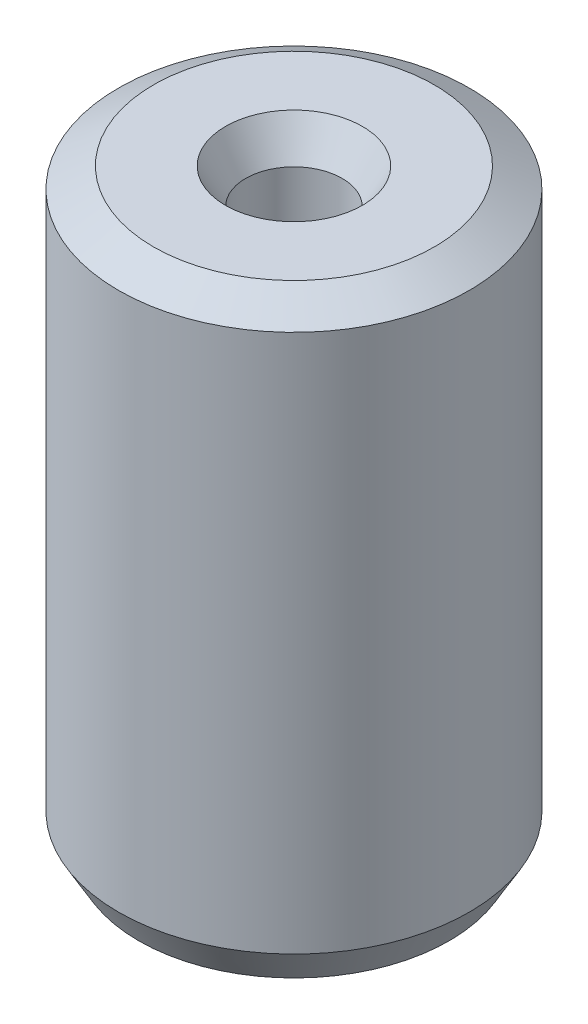
ISO-10303-21;
HEADER;
FILE_DESCRIPTION(('STEP AP214'),'2;1');
FILE_NAME('part.step','',(''),(''),'','','');
FILE_SCHEMA(('AUTOMOTIVE_DESIGN { 1 0 10303 214 1 1 1 1 }'));
ENDSEC;
DATA;
#1=APPLICATION_CONTEXT('core data for automotive mechanical design processes');
#2=APPLICATION_PROTOCOL_DEFINITION('international standard','automotive_design',2000,#1);
#3=PRODUCT_CONTEXT('',#1,'mechanical');
#4=PRODUCT('Part','Part','',(#3));
#5=PRODUCT_RELATED_PRODUCT_CATEGORY('part','',(#4));
#6=PRODUCT_DEFINITION_FORMATION('','',#4);
#7=PRODUCT_DEFINITION_CONTEXT('part definition',#1,'design');
#8=PRODUCT_DEFINITION('design','',#6,#7);
#9=PRODUCT_DEFINITION_SHAPE('','',#8);
#10=(LENGTH_UNIT() NAMED_UNIT(*) SI_UNIT(.MILLI.,.METRE.));
#11=(NAMED_UNIT(*) PLANE_ANGLE_UNIT() SI_UNIT($,.RADIAN.));
#12=(NAMED_UNIT(*) SI_UNIT($,.STERADIAN.) SOLID_ANGLE_UNIT());
#13=UNCERTAINTY_MEASURE_WITH_UNIT(LENGTH_MEASURE(1.E-05),#10,'distance_accuracy_value','');
#14=(GEOMETRIC_REPRESENTATION_CONTEXT(3) GLOBAL_UNCERTAINTY_ASSIGNED_CONTEXT((#13)) GLOBAL_UNIT_ASSIGNED_CONTEXT((#10,
#11,#12)) REPRESENTATION_CONTEXT('',''));
#15=CARTESIAN_POINT('',(0.,0.,0.));
#16=DIRECTION('',(0.,0.,1.));
#17=DIRECTION('',(1.,0.,0.));
#18=AXIS2_PLACEMENT_3D('',#15,#16,#17);
#19=CARTESIAN_POINT('',(0.,16.9244271968538,0.));
#20=DIRECTION('',(0.,-1.,0.));
#21=DIRECTION('',(0.,0.,-1.));
#22=AXIS2_PLACEMENT_3D('',#19,#20,#21);
#23=CYLINDRICAL_SURFACE('',#22,5.);
#24=CARTESIAN_POINT('',(0.,0.996584785743552,0.));
#25=DIRECTION('',(0.,1.,0.));
#26=DIRECTION('',(0.,0.,1.));
#27=AXIS2_PLACEMENT_3D('',#24,#25,#26);
#28=CIRCLE('',#27,5.);
#29=CARTESIAN_POINT('',(0.,0.996584785743552,5.));
#30=VERTEX_POINT('',#29);
#31=EDGE_CURVE('E10',#30,#30,#28,.T.);
#32=ORIENTED_EDGE('',*,*,#31,.T.);
#33=EDGE_LOOP('',(#32));
#34=FACE_BOUND('',#33,.T.);
#35=CARTESIAN_POINT('',(0.,16.3490487025344,0.));
#36=DIRECTION('',(0.,1.,0.));
#37=DIRECTION('',(0.,0.,1.));
#38=AXIS2_PLACEMENT_3D('',#35,#36,#37);
#39=CIRCLE('',#38,5.);
#40=CARTESIAN_POINT('',(0.,16.3490487025344,5.));
#41=VERTEX_POINT('',#40);
#42=EDGE_CURVE('E50',#41,#41,#39,.F.);
#43=ORIENTED_EDGE('',*,*,#42,.T.);
#44=EDGE_LOOP('',(#43));
#45=FACE_BOUND('',#44,.T.);
#46=ADVANCED_FACE('F39',(#34,#45),#23,.T.);
#47=CARTESIAN_POINT('',(0.,16.9244271968538,0.));
#48=DIRECTION('',(0.,1.,0.));
#49=DIRECTION('',(0.,0.,1.));
#50=AXIS2_PLACEMENT_3D('',#47,#48,#49);
#51=PLANE('',#50);
#52=CARTESIAN_POINT('',(0.,16.9244271968538,0.));
#53=DIRECTION('',(0.,1.,0.));
#54=DIRECTION('',(0.,0.,1.));
#55=AXIS2_PLACEMENT_3D('',#52,#53,#54);
#56=CIRCLE('',#55,1.95164584307682);
#57=CARTESIAN_POINT('',(0.,16.9244271968538,1.95164584307682));
#58=VERTEX_POINT('',#57);
#59=EDGE_CURVE('E58',#58,#58,#56,.F.);
#60=ORIENTED_EDGE('',*,*,#59,.T.);
#61=EDGE_LOOP('',(#60));
#62=FACE_BOUND('',#61,.T.);
#63=CARTESIAN_POINT('',(0.,16.9244271968538,0.));
#64=DIRECTION('',(0.,1.,0.));
#65=DIRECTION('',(0.,0.,1.));
#66=AXIS2_PLACEMENT_3D('',#63,#64,#65);
#67=CIRCLE('',#66,4.00341521425646);
#68=CARTESIAN_POINT('',(0.,16.9244271968538,4.00341521425646));
#69=VERTEX_POINT('',#68);
#70=EDGE_CURVE('E61',#69,#69,#67,.T.);
#71=ORIENTED_EDGE('',*,*,#70,.T.);
#72=EDGE_LOOP('',(#71));
#73=FACE_BOUND('',#72,.T.);
#74=ADVANCED_FACE('F88',(#62,#73),#51,.T.);
#75=CARTESIAN_POINT('',(0.,0.,0.));
#76=DIRECTION('',(0.,1.,0.));
#77=DIRECTION('',(0.,0.,1.));
#78=AXIS2_PLACEMENT_3D('',#75,#76,#77);
#79=PLANE('',#78);
#80=CARTESIAN_POINT('',(0.,0.,0.));
#81=DIRECTION('',(0.,1.,0.));
#82=DIRECTION('',(0.,0.,1.));
#83=AXIS2_PLACEMENT_3D('',#80,#81,#82);
#84=CIRCLE('',#83,2.37285213450103);
#85=CARTESIAN_POINT('',(0.,0.,2.37285213450103));
#86=VERTEX_POINT('',#85);
#87=EDGE_CURVE('E51',#86,#86,#84,.T.);
#88=ORIENTED_EDGE('',*,*,#87,.T.);
#89=EDGE_LOOP('',(#88));
#90=FACE_BOUND('',#89,.T.);
#91=CARTESIAN_POINT('',(0.,0.,0.));
#92=DIRECTION('',(0.,1.,0.));
#93=DIRECTION('',(0.,0.,1.));
#94=AXIS2_PLACEMENT_3D('',#91,#92,#93);
#95=CIRCLE('',#94,4.42462150568067);
#96=CARTESIAN_POINT('',(0.,0.,4.42462150568067));
#97=VERTEX_POINT('',#96);
#98=EDGE_CURVE('E54',#97,#97,#95,.F.);
#99=ORIENTED_EDGE('',*,*,#98,.T.);
#100=EDGE_LOOP('',(#99));
#101=FACE_BOUND('',#100,.T.);
#102=ADVANCED_FACE('F83',(#90,#101),#79,.F.);
#103=CARTESIAN_POINT('',(0.,16.9244271968538,0.));
#104=DIRECTION('',(0.,-1.,0.));
#105=DIRECTION('',(0.,0.,-1.));
#106=AXIS2_PLACEMENT_3D('',#103,#104,#105);
#107=CYLINDRICAL_SURFACE('',#106,1.37626734875749);
#108=CARTESIAN_POINT('',(0.,15.9278424111102,0.));
#109=DIRECTION('',(0.,1.,0.));
#110=DIRECTION('',(0.,0.,1.));
#111=AXIS2_PLACEMENT_3D('',#108,#109,#110);
#112=CIRCLE('',#111,1.37626734875749);
#113=CARTESIAN_POINT('',(0.,15.9278424111102,1.37626734875749));
#114=VERTEX_POINT('',#113);
#115=EDGE_CURVE('E67',#114,#114,#112,.T.);
#116=ORIENTED_EDGE('',*,*,#115,.T.);
#117=EDGE_LOOP('',(#116));
#118=FACE_BOUND('',#117,.T.);
#119=CARTESIAN_POINT('',(0.,0.575378494319326,0.));
#120=DIRECTION('',(0.,1.,0.));
#121=DIRECTION('',(0.,0.,1.));
#122=AXIS2_PLACEMENT_3D('',#119,#120,#121);
#123=CIRCLE('',#122,1.37626734875749);
#124=CARTESIAN_POINT('',(0.,0.575378494319326,1.37626734875749));
#125=VERTEX_POINT('',#124);
#126=EDGE_CURVE('E69',#125,#125,#123,.F.);
#127=ORIENTED_EDGE('',*,*,#126,.T.);
#128=EDGE_LOOP('',(#127));
#129=FACE_BOUND('',#128,.T.);
#130=ADVANCED_FACE('F71',(#118,#129),#107,.F.);
#131=CARTESIAN_POINT('',(0.,15.9278424111102,0.));
#132=DIRECTION('',(0.,1.,0.));
#133=DIRECTION('',(0.,0.,1.));
#134=AXIS2_PLACEMENT_3D('',#131,#132,#133);
#135=CONICAL_SURFACE('',#134,1.37626734875749,0.523598775598305);
#136=ORIENTED_EDGE('',*,*,#59,.F.);
#137=EDGE_LOOP('',(#136));
#138=FACE_BOUND('',#137,.T.);
#139=ORIENTED_EDGE('',*,*,#115,.F.);
#140=EDGE_LOOP('',(#139));
#141=FACE_BOUND('',#140,.T.);
#142=ADVANCED_FACE('F77',(#138,#141),#135,.F.);
#143=CARTESIAN_POINT('',(0.,0.,0.));
#144=DIRECTION('',(0.,-1.,0.));
#145=DIRECTION('',(0.,0.,-1.));
#146=AXIS2_PLACEMENT_3D('',#143,#144,#145);
#147=CONICAL_SURFACE('',#146,2.37285213450103,1.04719755119659);
#148=ORIENTED_EDGE('',*,*,#126,.F.);
#149=EDGE_LOOP('',(#148));
#150=FACE_BOUND('',#149,.T.);
#151=ORIENTED_EDGE('',*,*,#87,.F.);
#152=EDGE_LOOP('',(#151));
#153=FACE_BOUND('',#152,.T.);
#154=ADVANCED_FACE('F73',(#150,#153),#147,.F.);
#155=CARTESIAN_POINT('',(0.,0.996584785743552,0.));
#156=DIRECTION('',(0.,1.,0.));
#157=DIRECTION('',(0.,0.,1.));
#158=AXIS2_PLACEMENT_3D('',#155,#156,#157);
#159=CONICAL_SURFACE('',#158,5.,0.523598775598302);
#160=ORIENTED_EDGE('',*,*,#98,.F.);
#161=EDGE_LOOP('',(#160));
#162=FACE_BOUND('',#161,.T.);
#163=ORIENTED_EDGE('',*,*,#31,.F.);
#164=EDGE_LOOP('',(#163));
#165=FACE_BOUND('',#164,.T.);
#166=ADVANCED_FACE('F76',(#162,#165),#159,.T.);
#167=CARTESIAN_POINT('',(0.,16.9244271968538,0.));
#168=DIRECTION('',(0.,-1.,0.));
#169=DIRECTION('',(0.,0.,-1.));
#170=AXIS2_PLACEMENT_3D('',#167,#168,#169);
#171=CONICAL_SURFACE('',#170,4.00341521425646,1.0471975511966);
#172=ORIENTED_EDGE('',*,*,#42,.F.);
#173=EDGE_LOOP('',(#172));
#174=FACE_BOUND('',#173,.T.);
#175=ORIENTED_EDGE('',*,*,#70,.F.);
#176=EDGE_LOOP('',(#175));
#177=FACE_BOUND('',#176,.T.);
#178=ADVANCED_FACE('F45',(#174,#177),#171,.T.);
#179=CLOSED_SHELL('',(#46,#74,#102,#130,#142,#154,#166,#178));
#180=MANIFOLD_SOLID_BREP('B2',#179);
#181=ADVANCED_BREP_SHAPE_REPRESENTATION('',(#18,#180),#14);
#182=SHAPE_DEFINITION_REPRESENTATION(#9,#181);
ENDSEC;
END-ISO-10303-21;
